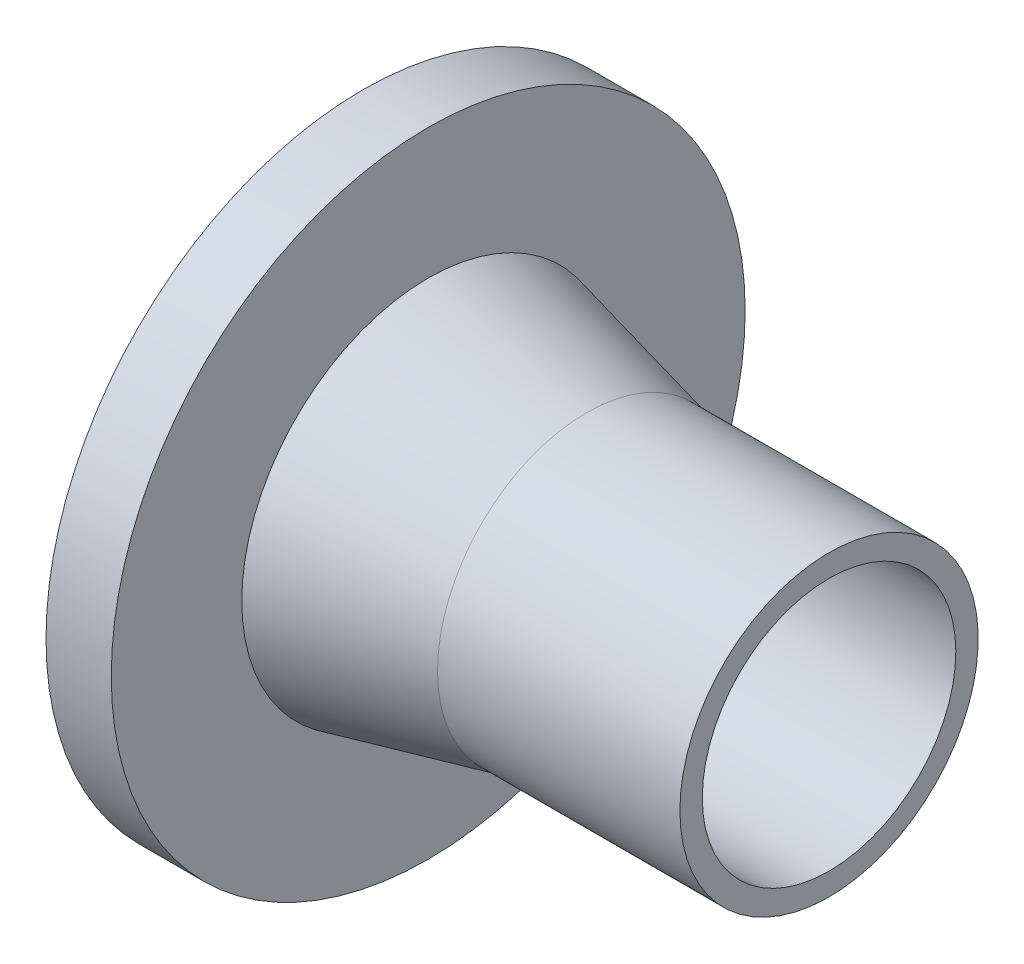
ISO-10303-21;
HEADER;
FILE_DESCRIPTION(('STEP AP214'),'2;1');
FILE_NAME('part.step','',(''),(''),'','','');
FILE_SCHEMA(('AUTOMOTIVE_DESIGN { 1 0 10303 214 1 1 1 1 }'));
ENDSEC;
DATA;
#1=APPLICATION_CONTEXT('core data for automotive mechanical design processes');
#2=APPLICATION_PROTOCOL_DEFINITION('international standard','automotive_design',2000,#1);
#3=PRODUCT_CONTEXT('',#1,'mechanical');
#4=PRODUCT('Part','Part','',(#3));
#5=PRODUCT_RELATED_PRODUCT_CATEGORY('part','',(#4));
#6=PRODUCT_DEFINITION_FORMATION('','',#4);
#7=PRODUCT_DEFINITION_CONTEXT('part definition',#1,'design');
#8=PRODUCT_DEFINITION('design','',#6,#7);
#9=PRODUCT_DEFINITION_SHAPE('','',#8);
#10=(LENGTH_UNIT() NAMED_UNIT(*) SI_UNIT(.MILLI.,.METRE.));
#11=(NAMED_UNIT(*) PLANE_ANGLE_UNIT() SI_UNIT($,.RADIAN.));
#12=(NAMED_UNIT(*) SI_UNIT($,.STERADIAN.) SOLID_ANGLE_UNIT());
#13=UNCERTAINTY_MEASURE_WITH_UNIT(LENGTH_MEASURE(1.E-05),#10,'distance_accuracy_value','');
#14=(GEOMETRIC_REPRESENTATION_CONTEXT(3) GLOBAL_UNCERTAINTY_ASSIGNED_CONTEXT((#13)) GLOBAL_UNIT_ASSIGNED_CONTEXT((#10,
#11,#12)) REPRESENTATION_CONTEXT('',''));
#15=CARTESIAN_POINT('',(0.,0.,0.));
#16=DIRECTION('',(0.,0.,1.));
#17=DIRECTION('',(1.,0.,0.));
#18=AXIS2_PLACEMENT_3D('',#15,#16,#17);
#19=CARTESIAN_POINT('',(-26.,0.,0.));
#20=DIRECTION('',(-1.,0.,0.));
#21=DIRECTION('',(0.,0.,1.));
#22=AXIS2_PLACEMENT_3D('',#19,#20,#21);
#23=CONICAL_SURFACE('',#22,16.,0.231090667195897);
#24=CARTESIAN_POINT('',(-43.,0.,0.));
#25=DIRECTION('',(-1.,0.,0.));
#26=DIRECTION('',(0.,0.,1.));
#27=AXIS2_PLACEMENT_3D('',#24,#25,#26);
#28=CIRCLE('',#27,20.);
#29=CARTESIAN_POINT('',(-43.,0.,20.));
#30=VERTEX_POINT('',#29);
#31=EDGE_CURVE('E15',#30,#30,#28,.T.);
#32=ORIENTED_EDGE('',*,*,#31,.F.);
#33=EDGE_LOOP('',(#32));
#34=FACE_BOUND('',#33,.T.);
#35=CARTESIAN_POINT('',(-26.,0.,0.));
#36=DIRECTION('',(-1.,0.,0.));
#37=DIRECTION('',(0.,1.,0.));
#38=AXIS2_PLACEMENT_3D('',#35,#36,#37);
#39=CIRCLE('',#38,16.);
#40=CARTESIAN_POINT('',(-26.,16.,0.));
#41=VERTEX_POINT('',#40);
#42=EDGE_CURVE('E27',#41,#41,#39,.F.);
#43=ORIENTED_EDGE('',*,*,#42,.F.);
#44=EDGE_LOOP('',(#43));
#45=FACE_BOUND('',#44,.T.);
#46=ADVANCED_FACE('F12',(#34,#45),#23,.T.);
#47=CARTESIAN_POINT('',(-43.,34.,34.4080021082586));
#48=DIRECTION('',(1.,0.,0.));
#49=DIRECTION('',(0.,-1.,0.));
#50=AXIS2_PLACEMENT_3D('',#47,#48,#49);
#51=PLANE('',#50);
#52=ORIENTED_EDGE('',*,*,#31,.T.);
#53=EDGE_LOOP('',(#52));
#54=FACE_BOUND('',#53,.T.);
#55=CARTESIAN_POINT('',(-43.,0.,0.));
#56=DIRECTION('',(-1.,0.,0.));
#57=DIRECTION('',(0.,0.,1.));
#58=AXIS2_PLACEMENT_3D('',#55,#56,#57);
#59=CIRCLE('',#58,34.);
#60=CARTESIAN_POINT('',(-43.,0.,34.));
#61=VERTEX_POINT('',#60);
#62=EDGE_CURVE('E33',#61,#61,#59,.T.);
#63=ORIENTED_EDGE('',*,*,#62,.F.);
#64=EDGE_LOOP('',(#63));
#65=FACE_BOUND('',#64,.T.);
#66=ADVANCED_FACE('F43',(#54,#65),#51,.T.);
#67=CARTESIAN_POINT('',(-26.,0.,0.));
#68=DIRECTION('',(-1.,0.,0.));
#69=DIRECTION('',(0.,0.,1.));
#70=AXIS2_PLACEMENT_3D('',#67,#68,#69);
#71=CYLINDRICAL_SURFACE('',#70,16.);
#72=ORIENTED_EDGE('',*,*,#42,.T.);
#73=EDGE_LOOP('',(#72));
#74=FACE_BOUND('',#73,.T.);
#75=CARTESIAN_POINT('',(0.,0.,0.));
#76=DIRECTION('',(-1.,0.,0.));
#77=DIRECTION('',(0.,0.,1.));
#78=AXIS2_PLACEMENT_3D('',#75,#76,#77);
#79=CIRCLE('',#78,16.);
#80=CARTESIAN_POINT('',(0.,0.,16.));
#81=VERTEX_POINT('',#80);
#82=EDGE_CURVE('E31',#81,#81,#79,.F.);
#83=ORIENTED_EDGE('',*,*,#82,.F.);
#84=EDGE_LOOP('',(#83));
#85=FACE_BOUND('',#84,.T.);
#86=ADVANCED_FACE('F52',(#74,#85),#71,.T.);
#87=CARTESIAN_POINT('',(-50.,0.,0.));
#88=DIRECTION('',(-1.,0.,0.));
#89=DIRECTION('',(0.,0.,1.));
#90=AXIS2_PLACEMENT_3D('',#87,#88,#89);
#91=CYLINDRICAL_SURFACE('',#90,34.);
#92=CARTESIAN_POINT('',(-50.,0.,0.));
#93=DIRECTION('',(-1.,0.,0.));
#94=DIRECTION('',(0.,0.,1.));
#95=AXIS2_PLACEMENT_3D('',#92,#93,#94);
#96=CIRCLE('',#95,34.);
#97=CARTESIAN_POINT('',(-50.,0.,34.));
#98=VERTEX_POINT('',#97);
#99=EDGE_CURVE('E24',#98,#98,#96,.T.);
#100=ORIENTED_EDGE('',*,*,#99,.F.);
#101=EDGE_LOOP('',(#100));
#102=FACE_BOUND('',#101,.T.);
#103=ORIENTED_EDGE('',*,*,#62,.T.);
#104=EDGE_LOOP('',(#103));
#105=FACE_BOUND('',#104,.T.);
#106=ADVANCED_FACE('F67',(#102,#105),#91,.T.);
#107=CARTESIAN_POINT('',(0.,16.,16.1920021082986));
#108=DIRECTION('',(1.,0.,0.));
#109=DIRECTION('',(0.,-1.,0.));
#110=AXIS2_PLACEMENT_3D('',#107,#108,#109);
#111=PLANE('',#110);
#112=CARTESIAN_POINT('',(0.,0.,0.));
#113=DIRECTION('',(-1.,0.,0.));
#114=DIRECTION('',(0.,0.,1.));
#115=AXIS2_PLACEMENT_3D('',#112,#113,#114);
#116=CIRCLE('',#115,13.6);
#117=CARTESIAN_POINT('',(0.,0.,13.6));
#118=VERTEX_POINT('',#117);
#119=EDGE_CURVE('E19',#118,#118,#116,.F.);
#120=ORIENTED_EDGE('',*,*,#119,.F.);
#121=EDGE_LOOP('',(#120));
#122=FACE_BOUND('',#121,.T.);
#123=ORIENTED_EDGE('',*,*,#82,.T.);
#124=EDGE_LOOP('',(#123));
#125=FACE_BOUND('',#124,.T.);
#126=ADVANCED_FACE('F61',(#122,#125),#111,.T.);
#127=CARTESIAN_POINT('',(-50.,-34.,34.4080021083692));
#128=DIRECTION('',(-1.,0.,0.));
#129=DIRECTION('',(0.,1.,0.));
#130=AXIS2_PLACEMENT_3D('',#127,#128,#129);
#131=PLANE('',#130);
#132=CARTESIAN_POINT('',(-50.,0.,0.));
#133=DIRECTION('',(-1.,0.,0.));
#134=DIRECTION('',(0.,0.,1.));
#135=AXIS2_PLACEMENT_3D('',#132,#133,#134);
#136=CIRCLE('',#135,13.6);
#137=CARTESIAN_POINT('',(-50.,0.,13.6));
#138=VERTEX_POINT('',#137);
#139=EDGE_CURVE('E8',#138,#138,#136,.T.);
#140=ORIENTED_EDGE('',*,*,#139,.F.);
#141=EDGE_LOOP('',(#140));
#142=FACE_BOUND('',#141,.T.);
#143=ORIENTED_EDGE('',*,*,#99,.T.);
#144=EDGE_LOOP('',(#143));
#145=FACE_BOUND('',#144,.T.);
#146=ADVANCED_FACE('F55',(#142,#145),#131,.T.);
#147=CARTESIAN_POINT('',(0.,0.,0.));
#148=DIRECTION('',(-1.,0.,0.));
#149=DIRECTION('',(0.,0.,1.));
#150=AXIS2_PLACEMENT_3D('',#147,#148,#149);
#151=CYLINDRICAL_SURFACE('',#150,13.6);
#152=ORIENTED_EDGE('',*,*,#119,.T.);
#153=EDGE_LOOP('',(#152));
#154=FACE_BOUND('',#153,.T.);
#155=ORIENTED_EDGE('',*,*,#139,.T.);
#156=EDGE_LOOP('',(#155));
#157=FACE_BOUND('',#156,.T.);
#158=ADVANCED_FACE('F53',(#154,#157),#151,.F.);
#159=CLOSED_SHELL('',(#46,#66,#86,#106,#126,#146,#158));
#160=MANIFOLD_SOLID_BREP('B1',#159);
#161=ADVANCED_BREP_SHAPE_REPRESENTATION('',(#18,#160),#14);
#162=SHAPE_DEFINITION_REPRESENTATION(#9,#161);
ENDSEC;
END-ISO-10303-21;
